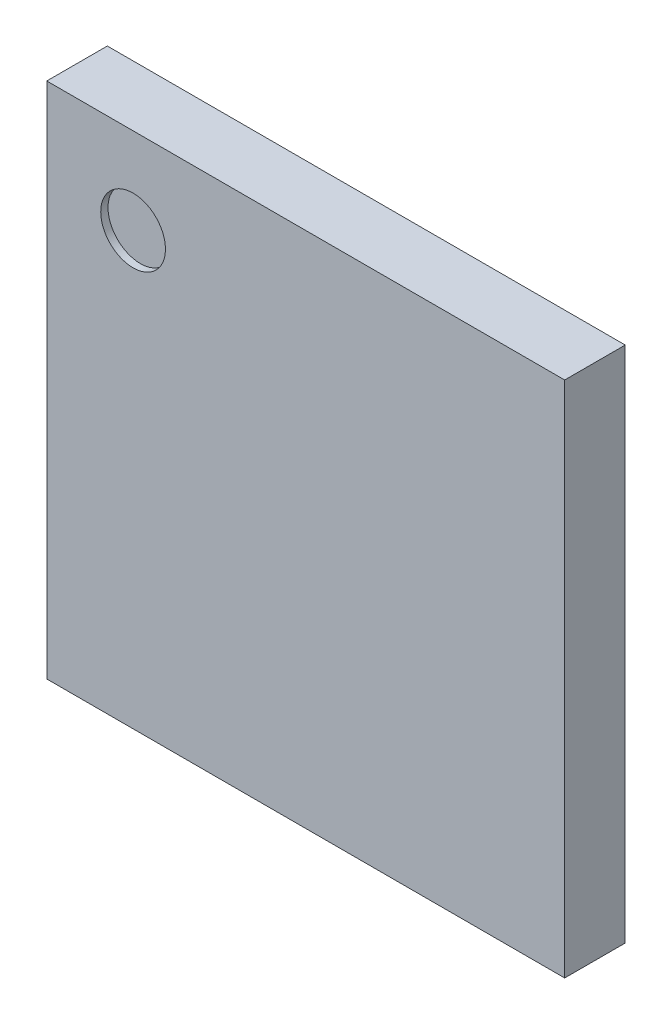
ISO-10303-21;
HEADER;
FILE_DESCRIPTION(('STEP AP214'),'2;1');
FILE_NAME('part.step','',(''),(''),'','','');
FILE_SCHEMA(('AUTOMOTIVE_DESIGN { 1 0 10303 214 1 1 1 1 }'));
ENDSEC;
DATA;
#1=APPLICATION_CONTEXT('core data for automotive mechanical design processes');
#2=APPLICATION_PROTOCOL_DEFINITION('international standard','automotive_design',2000,#1);
#3=PRODUCT_CONTEXT('',#1,'mechanical');
#4=PRODUCT('Part','Part','',(#3));
#5=PRODUCT_RELATED_PRODUCT_CATEGORY('part','',(#4));
#6=PRODUCT_DEFINITION_FORMATION('','',#4);
#7=PRODUCT_DEFINITION_CONTEXT('part definition',#1,'design');
#8=PRODUCT_DEFINITION('design','',#6,#7);
#9=PRODUCT_DEFINITION_SHAPE('','',#8);
#10=(LENGTH_UNIT() NAMED_UNIT(*) SI_UNIT(.MILLI.,.METRE.));
#11=(NAMED_UNIT(*) PLANE_ANGLE_UNIT() SI_UNIT($,.RADIAN.));
#12=(NAMED_UNIT(*) SI_UNIT($,.STERADIAN.) SOLID_ANGLE_UNIT());
#13=UNCERTAINTY_MEASURE_WITH_UNIT(LENGTH_MEASURE(1.E-05),#10,'distance_accuracy_value','');
#14=(GEOMETRIC_REPRESENTATION_CONTEXT(3) GLOBAL_UNCERTAINTY_ASSIGNED_CONTEXT((#13)) GLOBAL_UNIT_ASSIGNED_CONTEXT((#10,
#11,#12)) REPRESENTATION_CONTEXT('',''));
#15=CARTESIAN_POINT('',(0.,0.,0.));
#16=DIRECTION('',(0.,0.,1.));
#17=DIRECTION('',(1.,0.,0.));
#18=AXIS2_PLACEMENT_3D('',#15,#16,#17);
#19=CARTESIAN_POINT('',(1.183333333333,5.916666666667,0.73));
#20=DIRECTION('',(0.,0.,1.));
#21=DIRECTION('',(1.,0.,0.));
#22=AXIS2_PLACEMENT_3D('',#19,#20,#21);
#23=PLANE('',#22);
#24=CARTESIAN_POINT('',(1.183333333333,5.916666666667,0.73));
#25=DIRECTION('',(0.,0.,1.));
#26=DIRECTION('',(1.,0.,0.));
#27=AXIS2_PLACEMENT_3D('',#24,#25,#26);
#28=CIRCLE('',#27,0.44375);
#29=CARTESIAN_POINT('',(0.739583333333,5.916666666667,0.73));
#30=VERTEX_POINT('',#29);
#31=EDGE_CURVE('E27',#30,#30,#28,.T.);
#32=ORIENTED_EDGE('',*,*,#31,.T.);
#33=EDGE_LOOP('',(#32));
#34=FACE_BOUND('',#33,.T.);
#35=ADVANCED_FACE('F16',(#34),#23,.T.);
#36=CARTESIAN_POINT('',(1.183333333333,5.916666666667,0.73));
#37=DIRECTION('',(0.,0.,1.));
#38=DIRECTION('',(1.,0.,0.));
#39=AXIS2_PLACEMENT_3D('',#36,#37,#38);
#40=CYLINDRICAL_SURFACE('',#39,0.44375);
#41=ORIENTED_EDGE('',*,*,#31,.F.);
#42=DIRECTION('',(0.,0.,1.));
#43=VECTOR('',#42,1.);
#44=CARTESIAN_POINT('',(0.739583333333,5.916666666667,0.73));
#45=LINE('',#44,#43);
#46=CARTESIAN_POINT('',(0.739583333333,5.916666666667,0.83));
#47=VERTEX_POINT('',#46);
#48=EDGE_CURVE('E11',#30,#47,#45,.T.);
#49=ORIENTED_EDGE('',*,*,#48,.T.);
#50=CARTESIAN_POINT('',(1.183333333333,5.916666666667,0.83));
#51=DIRECTION('',(0.,0.,1.));
#52=DIRECTION('',(1.,0.,0.));
#53=AXIS2_PLACEMENT_3D('',#50,#51,#52);
#54=CIRCLE('',#53,0.44375);
#55=EDGE_CURVE('E20',#47,#47,#54,.T.);
#56=ORIENTED_EDGE('',*,*,#55,.T.);
#57=ORIENTED_EDGE('',*,*,#48,.F.);
#58=EDGE_LOOP('',(#41,#49,#56,#57));
#59=FACE_BOUND('',#58,.T.);
#60=ADVANCED_FACE('F153',(#59),#40,.F.);
#61=CARTESIAN_POINT('',(7.1,0.,0.));
#62=DIRECTION('',(1.,0.,0.));
#63=DIRECTION('',(0.,1.,0.));
#64=AXIS2_PLACEMENT_3D('',#61,#62,#63);
#65=PLANE('',#64);
#66=DIRECTION('',(0.,0.,1.));
#67=VECTOR('',#66,1.);
#68=CARTESIAN_POINT('',(7.1,0.,0.));
#69=LINE('',#68,#67);
#70=CARTESIAN_POINT('',(7.1,0.,0.));
#71=VERTEX_POINT('',#70);
#72=CARTESIAN_POINT('',(7.1,0.,0.83));
#73=VERTEX_POINT('',#72);
#74=EDGE_CURVE('E109',#71,#73,#69,.T.);
#75=ORIENTED_EDGE('',*,*,#74,.F.);
#76=DIRECTION('',(0.,1.,0.));
#77=VECTOR('',#76,1.);
#78=CARTESIAN_POINT('',(7.1,0.,0.));
#79=LINE('',#78,#77);
#80=CARTESIAN_POINT('',(7.1,7.1,0.));
#81=VERTEX_POINT('',#80);
#82=EDGE_CURVE('E92',#71,#81,#79,.T.);
#83=ORIENTED_EDGE('',*,*,#82,.T.);
#84=DIRECTION('',(0.,0.,1.));
#85=VECTOR('',#84,1.);
#86=CARTESIAN_POINT('',(7.1,7.1,0.));
#87=LINE('',#86,#85);
#88=CARTESIAN_POINT('',(7.1,7.1,0.83));
#89=VERTEX_POINT('',#88);
#90=EDGE_CURVE('E90',#81,#89,#87,.T.);
#91=ORIENTED_EDGE('',*,*,#90,.T.);
#92=DIRECTION('',(0.,1.,0.));
#93=VECTOR('',#92,1.);
#94=CARTESIAN_POINT('',(7.1,0.,0.83));
#95=LINE('',#94,#93);
#96=EDGE_CURVE('E87',#73,#89,#95,.T.);
#97=ORIENTED_EDGE('',*,*,#96,.F.);
#98=EDGE_LOOP('',(#75,#83,#91,#97));
#99=FACE_BOUND('',#98,.T.);
#100=ADVANCED_FACE('F91',(#99),#65,.T.);
#101=CARTESIAN_POINT('',(0.,0.,0.));
#102=DIRECTION('',(0.,0.,1.));
#103=DIRECTION('',(1.,0.,0.));
#104=AXIS2_PLACEMENT_3D('',#101,#102,#103);
#105=PLANE('',#104);
#106=DIRECTION('',(0.,1.,0.));
#107=VECTOR('',#106,1.);
#108=CARTESIAN_POINT('',(0.,0.,0.));
#109=LINE('',#108,#107);
#110=CARTESIAN_POINT('',(0.,0.,0.));
#111=VERTEX_POINT('',#110);
#112=CARTESIAN_POINT('',(0.,7.1,0.));
#113=VERTEX_POINT('',#112);
#114=EDGE_CURVE('E121',#111,#113,#109,.T.);
#115=ORIENTED_EDGE('',*,*,#114,.T.);
#116=DIRECTION('',(1.,0.,0.));
#117=VECTOR('',#116,1.);
#118=CARTESIAN_POINT('',(0.,7.1,0.));
#119=LINE('',#118,#117);
#120=EDGE_CURVE('E96',#113,#81,#119,.T.);
#121=ORIENTED_EDGE('',*,*,#120,.T.);
#122=ORIENTED_EDGE('',*,*,#82,.F.);
#123=DIRECTION('',(1.,0.,0.));
#124=VECTOR('',#123,1.);
#125=CARTESIAN_POINT('',(0.,0.,0.));
#126=LINE('',#125,#124);
#127=EDGE_CURVE('E128',#111,#71,#126,.T.);
#128=ORIENTED_EDGE('',*,*,#127,.F.);
#129=EDGE_LOOP('',(#115,#121,#122,#128));
#130=FACE_BOUND('',#129,.T.);
#131=ADVANCED_FACE('F141',(#130),#105,.F.);
#132=CARTESIAN_POINT('',(0.,7.1,0.));
#133=DIRECTION('',(0.,1.,0.));
#134=DIRECTION('',(1.,0.,0.));
#135=AXIS2_PLACEMENT_3D('',#132,#133,#134);
#136=PLANE('',#135);
#137=ORIENTED_EDGE('',*,*,#120,.F.);
#138=DIRECTION('',(0.,0.,1.));
#139=VECTOR('',#138,1.);
#140=CARTESIAN_POINT('',(0.,7.1,0.));
#141=LINE('',#140,#139);
#142=CARTESIAN_POINT('',(0.,7.1,0.83));
#143=VERTEX_POINT('',#142);
#144=EDGE_CURVE('E99',#113,#143,#141,.T.);
#145=ORIENTED_EDGE('',*,*,#144,.T.);
#146=DIRECTION('',(1.,0.,0.));
#147=VECTOR('',#146,1.);
#148=CARTESIAN_POINT('',(0.,7.1,0.83));
#149=LINE('',#148,#147);
#150=EDGE_CURVE('E68',#143,#89,#149,.T.);
#151=ORIENTED_EDGE('',*,*,#150,.T.);
#152=ORIENTED_EDGE('',*,*,#90,.F.);
#153=EDGE_LOOP('',(#137,#145,#151,#152));
#154=FACE_BOUND('',#153,.T.);
#155=ADVANCED_FACE('F18',(#154),#136,.T.);
#156=CARTESIAN_POINT('',(0.,0.,0.83));
#157=DIRECTION('',(0.,0.,1.));
#158=DIRECTION('',(1.,0.,0.));
#159=AXIS2_PLACEMENT_3D('',#156,#157,#158);
#160=PLANE('',#159);
#161=ORIENTED_EDGE('',*,*,#55,.F.);
#162=EDGE_LOOP('',(#161));
#163=FACE_BOUND('',#162,.T.);
#164=DIRECTION('',(0.,1.,0.));
#165=VECTOR('',#164,1.);
#166=CARTESIAN_POINT('',(0.,0.,0.83));
#167=LINE('',#166,#165);
#168=CARTESIAN_POINT('',(0.,0.,0.83));
#169=VERTEX_POINT('',#168);
#170=EDGE_CURVE('E112',#169,#143,#167,.T.);
#171=ORIENTED_EDGE('',*,*,#170,.F.);
#172=DIRECTION('',(1.,0.,0.));
#173=VECTOR('',#172,1.);
#174=CARTESIAN_POINT('',(0.,0.,0.83));
#175=LINE('',#174,#173);
#176=EDGE_CURVE('E80',#169,#73,#175,.T.);
#177=ORIENTED_EDGE('',*,*,#176,.T.);
#178=ORIENTED_EDGE('',*,*,#96,.T.);
#179=ORIENTED_EDGE('',*,*,#150,.F.);
#180=EDGE_LOOP('',(#171,#177,#178,#179));
#181=FACE_BOUND('',#180,.T.);
#182=ADVANCED_FACE('F102',(#163,#181),#160,.T.);
#183=CARTESIAN_POINT('',(0.,0.,0.));
#184=DIRECTION('',(0.,1.,0.));
#185=DIRECTION('',(1.,0.,0.));
#186=AXIS2_PLACEMENT_3D('',#183,#184,#185);
#187=PLANE('',#186);
#188=ORIENTED_EDGE('',*,*,#127,.T.);
#189=ORIENTED_EDGE('',*,*,#74,.T.);
#190=ORIENTED_EDGE('',*,*,#176,.F.);
#191=DIRECTION('',(0.,0.,1.));
#192=VECTOR('',#191,1.);
#193=CARTESIAN_POINT('',(0.,0.,0.));
#194=LINE('',#193,#192);
#195=EDGE_CURVE('E115',#111,#169,#194,.T.);
#196=ORIENTED_EDGE('',*,*,#195,.F.);
#197=EDGE_LOOP('',(#188,#189,#190,#196));
#198=FACE_BOUND('',#197,.T.);
#199=ADVANCED_FACE('F138',(#198),#187,.F.);
#200=CARTESIAN_POINT('',(0.,0.,0.));
#201=DIRECTION('',(1.,0.,0.));
#202=DIRECTION('',(0.,1.,0.));
#203=AXIS2_PLACEMENT_3D('',#200,#201,#202);
#204=PLANE('',#203);
#205=ORIENTED_EDGE('',*,*,#195,.T.);
#206=ORIENTED_EDGE('',*,*,#170,.T.);
#207=ORIENTED_EDGE('',*,*,#144,.F.);
#208=ORIENTED_EDGE('',*,*,#114,.F.);
#209=EDGE_LOOP('',(#205,#206,#207,#208));
#210=FACE_BOUND('',#209,.T.);
#211=ADVANCED_FACE('F143',(#210),#204,.F.);
#212=CLOSED_SHELL('',(#35,#60,#100,#131,#155,#182,#199,#211));
#213=MANIFOLD_SOLID_BREP('B1',#212);
#214=ADVANCED_BREP_SHAPE_REPRESENTATION('',(#18,#213),#14);
#215=SHAPE_DEFINITION_REPRESENTATION(#9,#214);
ENDSEC;
END-ISO-10303-21;
